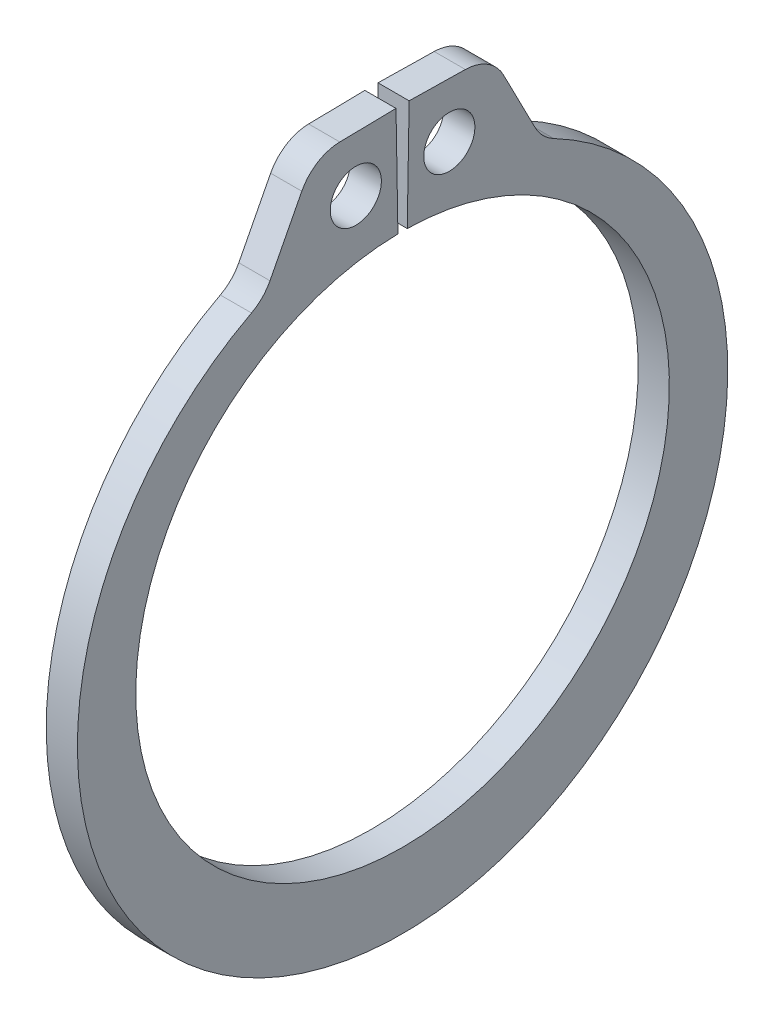
ISO-10303-21;
HEADER;
FILE_DESCRIPTION(('STEP AP214'),'2;1');
FILE_NAME('part.step','',(''),(''),'','','');
FILE_SCHEMA(('AUTOMOTIVE_DESIGN { 1 0 10303 214 1 1 1 1 }'));
ENDSEC;
DATA;
#1=APPLICATION_CONTEXT('core data for automotive mechanical design processes');
#2=APPLICATION_PROTOCOL_DEFINITION('international standard','automotive_design',2000,#1);
#3=PRODUCT_CONTEXT('',#1,'mechanical');
#4=PRODUCT('Part','Part','',(#3));
#5=PRODUCT_RELATED_PRODUCT_CATEGORY('part','',(#4));
#6=PRODUCT_DEFINITION_FORMATION('','',#4);
#7=PRODUCT_DEFINITION_CONTEXT('part definition',#1,'design');
#8=PRODUCT_DEFINITION('design','',#6,#7);
#9=PRODUCT_DEFINITION_SHAPE('','',#8);
#10=(LENGTH_UNIT() NAMED_UNIT(*) SI_UNIT(.MILLI.,.METRE.));
#11=(NAMED_UNIT(*) PLANE_ANGLE_UNIT() SI_UNIT($,.RADIAN.));
#12=(NAMED_UNIT(*) SI_UNIT($,.STERADIAN.) SOLID_ANGLE_UNIT());
#13=UNCERTAINTY_MEASURE_WITH_UNIT(LENGTH_MEASURE(1.E-05),#10,'distance_accuracy_value','');
#14=(GEOMETRIC_REPRESENTATION_CONTEXT(3) GLOBAL_UNCERTAINTY_ASSIGNED_CONTEXT((#13)) GLOBAL_UNIT_ASSIGNED_CONTEXT((#10,
#11,#12)) REPRESENTATION_CONTEXT('',''));
#15=CARTESIAN_POINT('',(0.,0.,0.));
#16=DIRECTION('',(0.,0.,1.));
#17=DIRECTION('',(1.,0.,0.));
#18=AXIS2_PLACEMENT_3D('',#15,#16,#17);
#19=CARTESIAN_POINT('',(0.3175,0.,0.));
#20=DIRECTION('',(1.,0.,0.));
#21=DIRECTION('',(0.,0.,-1.));
#22=AXIS2_PLACEMENT_3D('',#19,#20,#21);
#23=PLANE('',#22);
#24=CARTESIAN_POINT('',(0.3175,6.53757330882311,0.952441447944874));
#25=DIRECTION('',(1.,0.,0.));
#26=DIRECTION('',(0.,0.,-1.));
#27=AXIS2_PLACEMENT_3D('',#24,#25,#26);
#28=CIRCLE('',#27,0.5207);
#29=CARTESIAN_POINT('',(0.3175,6.53757330882311,0.431741447944874));
#30=VERTEX_POINT('',#29);
#31=EDGE_CURVE('E229',#30,#30,#28,.T.);
#32=ORIENTED_EDGE('',*,*,#31,.F.);
#33=EDGE_LOOP('',(#32));
#34=FACE_BOUND('',#33,.T.);
#35=DIRECTION('',(0.,-0.0174524064372771,0.999847695156391));
#36=VECTOR('',#35,1.);
#37=CARTESIAN_POINT('',(0.3175,7.66963170000565,0.133873919299115));
#38=LINE('',#37,#36);
#39=CARTESIAN_POINT('',(0.3175,7.66963170000565,0.133873919299115));
#40=VERTEX_POINT('',#39);
#41=CARTESIAN_POINT('',(0.3175,7.64964498771418,1.27891189960262));
#42=VERTEX_POINT('',#41);
#43=EDGE_CURVE('E141',#40,#42,#38,.T.);
#44=ORIENTED_EDGE('',*,*,#43,.T.);
#45=CARTESIAN_POINT('',(0.3175,6.76078038672015,1.26339671027988));
#46=DIRECTION('',(1.,0.,0.));
#47=DIRECTION('',(0.,0.,-1.));
#48=AXIS2_PLACEMENT_3D('',#45,#46,#47);
#49=CIRCLE('',#48,0.889);
#50=CARTESIAN_POINT('',(0.3175,7.16827724391612,2.05350259645933));
#51=VERTEX_POINT('',#50);
#52=EDGE_CURVE('E182',#42,#51,#49,.T.);
#53=ORIENTED_EDGE('',*,*,#52,.T.);
#54=DIRECTION('',(0.,-0.888758027198479,0.458376667262055));
#55=VECTOR('',#54,1.);
#56=CARTESIAN_POINT('',(0.3175,7.6403744858542,1.81001859545929));
#57=LINE('',#56,#55);
#58=CARTESIAN_POINT('',(0.3175,5.91184475207108,2.70150725085));
#59=VERTEX_POINT('',#58);
#60=EDGE_CURVE('E221',#51,#59,#57,.T.);
#61=ORIENTED_EDGE('',*,*,#60,.T.);
#62=CARTESIAN_POINT('',(0.3175,6.31934160926705,3.49161313702945));
#63=DIRECTION('',(1.,0.,0.));
#64=DIRECTION('',(0.,0.,-1.));
#65=AXIS2_PLACEMENT_3D('',#62,#63,#64);
#66=CIRCLE('',#65,0.889);
#67=CARTESIAN_POINT('',(0.3175,5.5321453172725,3.07852356094451));
#68=VERTEX_POINT('',#67);
#69=EDGE_CURVE('E189',#59,#68,#66,.F.);
#70=ORIENTED_EDGE('',*,*,#69,.T.);
#71=CARTESIAN_POINT('',(0.3175,-0.334384540394782,0.));
#72=DIRECTION('',(1.,0.,0.));
#73=DIRECTION('',(0.,0.,-1.));
#74=AXIS2_PLACEMENT_3D('',#71,#72,#73);
#75=CIRCLE('',#74,6.62521545960523);
#76=CARTESIAN_POINT('',(0.3175,5.5321453172725,-3.07852356094451));
#77=VERTEX_POINT('',#76);
#78=EDGE_CURVE('E214',#68,#77,#75,.T.);
#79=ORIENTED_EDGE('',*,*,#78,.T.);
#80=CARTESIAN_POINT('',(0.3175,6.31934160926705,-3.49161313702945));
#81=DIRECTION('',(1.,0.,0.));
#82=DIRECTION('',(0.,0.,-1.));
#83=AXIS2_PLACEMENT_3D('',#80,#81,#82);
#84=CIRCLE('',#83,0.889);
#85=CARTESIAN_POINT('',(0.3175,5.91184475207108,-2.70150725085));
#86=VERTEX_POINT('',#85);
#87=EDGE_CURVE('E13',#77,#86,#84,.F.);
#88=ORIENTED_EDGE('',*,*,#87,.T.);
#89=DIRECTION('',(0.,0.888758027198479,0.458376667262055));
#90=VECTOR('',#89,1.);
#91=CARTESIAN_POINT('',(0.3175,7.6403744858542,-1.81001859545929));
#92=LINE('',#91,#90);
#93=CARTESIAN_POINT('',(0.3175,7.16827724391612,-2.05350259645933));
#94=VERTEX_POINT('',#93);
#95=EDGE_CURVE('E213',#86,#94,#92,.T.);
#96=ORIENTED_EDGE('',*,*,#95,.T.);
#97=CARTESIAN_POINT('',(0.3175,6.76078038672015,-1.26339671027988));
#98=DIRECTION('',(1.,0.,0.));
#99=DIRECTION('',(0.,0.,-1.));
#100=AXIS2_PLACEMENT_3D('',#97,#98,#99);
#101=CIRCLE('',#100,0.889);
#102=CARTESIAN_POINT('',(0.3175,7.64964498771418,-1.27891189960262));
#103=VERTEX_POINT('',#102);
#104=EDGE_CURVE('E57',#94,#103,#101,.T.);
#105=ORIENTED_EDGE('',*,*,#104,.T.);
#106=DIRECTION('',(0.,0.0174524064372771,0.999847695156391));
#107=VECTOR('',#106,1.);
#108=CARTESIAN_POINT('',(0.3175,7.66963170000565,-0.133873919299115));
#109=LINE('',#108,#107);
#110=CARTESIAN_POINT('',(0.3175,7.66963170000565,-0.133873919299115));
#111=VERTEX_POINT('',#110);
#112=EDGE_CURVE('E218',#103,#111,#109,.T.);
#113=ORIENTED_EDGE('',*,*,#112,.T.);
#114=DIRECTION('',(0.,-0.999847695156391,0.0174524064372833));
#115=VECTOR('',#114,1.);
#116=CARTESIAN_POINT('',(0.3175,5.43477213179208,-0.0948643004304991));
#117=LINE('',#116,#115);
#118=CARTESIAN_POINT('',(0.3175,5.43477213179208,-0.0948643004304991));
#119=VERTEX_POINT('',#118);
#120=EDGE_CURVE('E147',#111,#119,#117,.T.);
#121=ORIENTED_EDGE('',*,*,#120,.T.);
#122=CARTESIAN_POINT('',(0.3175,0.,0.));
#123=DIRECTION('',(-1.,0.,0.));
#124=DIRECTION('',(0.,0.,-1.));
#125=AXIS2_PLACEMENT_3D('',#122,#123,#124);
#126=CIRCLE('',#125,5.4356);
#127=CARTESIAN_POINT('',(0.3175,5.43477213179208,0.0948643004304991));
#128=VERTEX_POINT('',#127);
#129=EDGE_CURVE('E142',#119,#128,#126,.T.);
#130=ORIENTED_EDGE('',*,*,#129,.T.);
#131=DIRECTION('',(0.,0.999847695156391,0.0174524064372833));
#132=VECTOR('',#131,1.);
#133=CARTESIAN_POINT('',(0.3175,5.43477213179208,0.0948643004304991));
#134=LINE('',#133,#132);
#135=EDGE_CURVE('E133',#128,#40,#134,.T.);
#136=ORIENTED_EDGE('',*,*,#135,.T.);
#137=EDGE_LOOP('',(#44,#53,#61,#70,#79,#88,#96,#105,#113,#121,#130,#136));
#138=FACE_BOUND('',#137,.T.);
#139=CARTESIAN_POINT('',(0.3175,6.53757330882311,-0.952441447944874));
#140=DIRECTION('',(1.,0.,0.));
#141=DIRECTION('',(0.,0.,-1.));
#142=AXIS2_PLACEMENT_3D('',#139,#140,#141);
#143=CIRCLE('',#142,0.5207);
#144=CARTESIAN_POINT('',(0.3175,6.53757330882311,-1.47314144794487));
#145=VERTEX_POINT('',#144);
#146=EDGE_CURVE('E255',#145,#145,#143,.T.);
#147=ORIENTED_EDGE('',*,*,#146,.F.);
#148=EDGE_LOOP('',(#147));
#149=FACE_BOUND('',#148,.T.);
#150=ADVANCED_FACE('F42',(#34,#138,#149),#23,.T.);
#151=CARTESIAN_POINT('',(-0.3175,0.,0.));
#152=DIRECTION('',(1.,0.,0.));
#153=DIRECTION('',(0.,0.,-1.));
#154=AXIS2_PLACEMENT_3D('',#151,#152,#153);
#155=PLANE('',#154);
#156=CARTESIAN_POINT('',(-0.3175,6.53757330882311,0.952441447944874));
#157=DIRECTION('',(1.,0.,0.));
#158=DIRECTION('',(0.,0.,-1.));
#159=AXIS2_PLACEMENT_3D('',#156,#157,#158);
#160=CIRCLE('',#159,0.5207);
#161=CARTESIAN_POINT('',(-0.3175,6.53757330882311,0.431741447944874));
#162=VERTEX_POINT('',#161);
#163=EDGE_CURVE('E252',#162,#162,#160,.T.);
#164=ORIENTED_EDGE('',*,*,#163,.T.);
#165=EDGE_LOOP('',(#164));
#166=FACE_BOUND('',#165,.T.);
#167=DIRECTION('',(0.,-0.888758027198479,0.458376667262055));
#168=VECTOR('',#167,1.);
#169=CARTESIAN_POINT('',(-0.3175,7.6403744858542,1.81001859545929));
#170=LINE('',#169,#168);
#171=CARTESIAN_POINT('',(-0.3175,7.16827724391612,2.05350259645933));
#172=VERTEX_POINT('',#171);
#173=CARTESIAN_POINT('',(-0.3175,5.91184475207108,2.70150725085));
#174=VERTEX_POINT('',#173);
#175=EDGE_CURVE('E208',#172,#174,#170,.T.);
#176=ORIENTED_EDGE('',*,*,#175,.F.);
#177=CARTESIAN_POINT('',(-0.3175,6.76078038672015,1.26339671027988));
#178=DIRECTION('',(1.,0.,0.));
#179=DIRECTION('',(0.,0.,-1.));
#180=AXIS2_PLACEMENT_3D('',#177,#178,#179);
#181=CIRCLE('',#180,0.889);
#182=CARTESIAN_POINT('',(-0.3175,7.64964498771418,1.27891189960262));
#183=VERTEX_POINT('',#182);
#184=EDGE_CURVE('E178',#172,#183,#181,.F.);
#185=ORIENTED_EDGE('',*,*,#184,.T.);
#186=DIRECTION('',(0.,-0.0174524064372771,0.999847695156391));
#187=VECTOR('',#186,1.);
#188=CARTESIAN_POINT('',(-0.3175,7.66963170000565,0.133873919299115));
#189=LINE('',#188,#187);
#190=CARTESIAN_POINT('',(-0.3175,7.66963170000565,0.133873919299115));
#191=VERTEX_POINT('',#190);
#192=EDGE_CURVE('E231',#191,#183,#189,.T.);
#193=ORIENTED_EDGE('',*,*,#192,.F.);
#194=DIRECTION('',(0.,0.999847695156391,0.0174524064372833));
#195=VECTOR('',#194,1.);
#196=CARTESIAN_POINT('',(-0.3175,5.43477213179208,0.0948643004304991));
#197=LINE('',#196,#195);
#198=CARTESIAN_POINT('',(-0.3175,5.43477213179208,0.0948643004304991));
#199=VERTEX_POINT('',#198);
#200=EDGE_CURVE('E228',#199,#191,#197,.T.);
#201=ORIENTED_EDGE('',*,*,#200,.F.);
#202=CARTESIAN_POINT('',(-0.3175,0.,0.));
#203=DIRECTION('',(-1.,0.,0.));
#204=DIRECTION('',(0.,0.,-1.));
#205=AXIS2_PLACEMENT_3D('',#202,#203,#204);
#206=CIRCLE('',#205,5.4356);
#207=CARTESIAN_POINT('',(-0.3175,5.43477213179208,-0.0948643004304991));
#208=VERTEX_POINT('',#207);
#209=EDGE_CURVE('E155',#208,#199,#206,.T.);
#210=ORIENTED_EDGE('',*,*,#209,.F.);
#211=DIRECTION('',(0.,-0.999847695156391,0.0174524064372833));
#212=VECTOR('',#211,1.);
#213=CARTESIAN_POINT('',(-0.3175,5.43477213179208,-0.0948643004304991));
#214=LINE('',#213,#212);
#215=CARTESIAN_POINT('',(-0.3175,7.66963170000565,-0.133873919299115));
#216=VERTEX_POINT('',#215);
#217=EDGE_CURVE('E151',#216,#208,#214,.T.);
#218=ORIENTED_EDGE('',*,*,#217,.F.);
#219=DIRECTION('',(0.,0.0174524064372771,0.999847695156391));
#220=VECTOR('',#219,1.);
#221=CARTESIAN_POINT('',(-0.3175,7.66963170000565,-0.133873919299115));
#222=LINE('',#221,#220);
#223=CARTESIAN_POINT('',(-0.3175,7.64964498771418,-1.27891189960262));
#224=VERTEX_POINT('',#223);
#225=EDGE_CURVE('E236',#224,#216,#222,.T.);
#226=ORIENTED_EDGE('',*,*,#225,.F.);
#227=CARTESIAN_POINT('',(-0.3175,6.76078038672015,-1.26339671027988));
#228=DIRECTION('',(1.,0.,0.));
#229=DIRECTION('',(0.,0.,-1.));
#230=AXIS2_PLACEMENT_3D('',#227,#228,#229);
#231=CIRCLE('',#230,0.889);
#232=CARTESIAN_POINT('',(-0.3175,7.16827724391612,-2.05350259645933));
#233=VERTEX_POINT('',#232);
#234=EDGE_CURVE('E176',#224,#233,#231,.F.);
#235=ORIENTED_EDGE('',*,*,#234,.T.);
#236=DIRECTION('',(0.,0.888758027198479,0.458376667262055));
#237=VECTOR('',#236,1.);
#238=CARTESIAN_POINT('',(-0.3175,7.6403744858542,-1.81001859545929));
#239=LINE('',#238,#237);
#240=CARTESIAN_POINT('',(-0.3175,5.91184475207108,-2.70150725085));
#241=VERTEX_POINT('',#240);
#242=EDGE_CURVE('E199',#241,#233,#239,.T.);
#243=ORIENTED_EDGE('',*,*,#242,.F.);
#244=CARTESIAN_POINT('',(-0.3175,6.31934160926705,-3.49161313702945));
#245=DIRECTION('',(1.,0.,0.));
#246=DIRECTION('',(0.,0.,-1.));
#247=AXIS2_PLACEMENT_3D('',#244,#245,#246);
#248=CIRCLE('',#247,0.889);
#249=CARTESIAN_POINT('',(-0.3175,5.5321453172725,-3.07852356094451));
#250=VERTEX_POINT('',#249);
#251=EDGE_CURVE('E50',#241,#250,#248,.T.);
#252=ORIENTED_EDGE('',*,*,#251,.T.);
#253=CARTESIAN_POINT('',(-0.3175,-0.334384540394782,0.));
#254=DIRECTION('',(1.,0.,0.));
#255=DIRECTION('',(0.,0.,-1.));
#256=AXIS2_PLACEMENT_3D('',#253,#254,#255);
#257=CIRCLE('',#256,6.62521545960523);
#258=CARTESIAN_POINT('',(-0.3175,5.5321453172725,3.07852356094451));
#259=VERTEX_POINT('',#258);
#260=EDGE_CURVE('E197',#259,#250,#257,.T.);
#261=ORIENTED_EDGE('',*,*,#260,.F.);
#262=CARTESIAN_POINT('',(-0.3175,6.31934160926705,3.49161313702945));
#263=DIRECTION('',(1.,0.,0.));
#264=DIRECTION('',(0.,0.,-1.));
#265=AXIS2_PLACEMENT_3D('',#262,#263,#264);
#266=CIRCLE('',#265,0.889);
#267=EDGE_CURVE('E187',#259,#174,#266,.T.);
#268=ORIENTED_EDGE('',*,*,#267,.T.);
#269=EDGE_LOOP('',(#176,#185,#193,#201,#210,#218,#226,#235,#243,#252,#261,#268));
#270=FACE_BOUND('',#269,.T.);
#271=CARTESIAN_POINT('',(-0.3175,6.53757330882311,-0.952441447944874));
#272=DIRECTION('',(1.,0.,0.));
#273=DIRECTION('',(0.,0.,-1.));
#274=AXIS2_PLACEMENT_3D('',#271,#272,#273);
#275=CIRCLE('',#274,0.5207);
#276=CARTESIAN_POINT('',(-0.3175,6.53757330882311,-1.47314144794487));
#277=VERTEX_POINT('',#276);
#278=EDGE_CURVE('E258',#277,#277,#275,.T.);
#279=ORIENTED_EDGE('',*,*,#278,.T.);
#280=EDGE_LOOP('',(#279));
#281=FACE_BOUND('',#280,.T.);
#282=ADVANCED_FACE('F195',(#166,#270,#281),#155,.F.);
#283=CARTESIAN_POINT('',(0.3175,0.,0.));
#284=DIRECTION('',(-1.,0.,0.));
#285=DIRECTION('',(0.,0.,1.));
#286=AXIS2_PLACEMENT_3D('',#283,#284,#285);
#287=CYLINDRICAL_SURFACE('',#286,5.4356);
#288=ORIENTED_EDGE('',*,*,#209,.T.);
#289=DIRECTION('',(-1.,0.,0.));
#290=VECTOR('',#289,1.);
#291=CARTESIAN_POINT('',(0.3175,5.43477213179208,0.0948643004304991));
#292=LINE('',#291,#290);
#293=EDGE_CURVE('E137',#128,#199,#292,.T.);
#294=ORIENTED_EDGE('',*,*,#293,.F.);
#295=ORIENTED_EDGE('',*,*,#129,.F.);
#296=DIRECTION('',(-1.,0.,0.));
#297=VECTOR('',#296,1.);
#298=CARTESIAN_POINT('',(0.3175,5.43477213179208,-0.0948643004304991));
#299=LINE('',#298,#297);
#300=EDGE_CURVE('E226',#119,#208,#299,.T.);
#301=ORIENTED_EDGE('',*,*,#300,.T.);
#302=EDGE_LOOP('',(#288,#294,#295,#301));
#303=FACE_BOUND('',#302,.T.);
#304=ADVANCED_FACE('F153',(#303),#287,.F.);
#305=CARTESIAN_POINT('',(0.3175,5.43477213179208,0.0948643004304991));
#306=DIRECTION('',(0.,-0.0174524064372833,0.999847695156391));
#307=DIRECTION('',(0.,-0.999847695156391,-0.0174524064372833));
#308=AXIS2_PLACEMENT_3D('',#305,#306,#307);
#309=PLANE('',#308);
#310=ORIENTED_EDGE('',*,*,#200,.T.);
#311=DIRECTION('',(-1.,0.,0.));
#312=VECTOR('',#311,1.);
#313=CARTESIAN_POINT('',(0.3175,7.66963170000565,0.133873919299115));
#314=LINE('',#313,#312);
#315=EDGE_CURVE('E140',#40,#191,#314,.T.);
#316=ORIENTED_EDGE('',*,*,#315,.F.);
#317=ORIENTED_EDGE('',*,*,#135,.F.);
#318=ORIENTED_EDGE('',*,*,#293,.T.);
#319=EDGE_LOOP('',(#310,#316,#317,#318));
#320=FACE_BOUND('',#319,.T.);
#321=ADVANCED_FACE('F135',(#320),#309,.F.);
#322=CARTESIAN_POINT('',(0.3175,7.66963170000565,0.133873919299115));
#323=DIRECTION('',(0.,-0.999847695156391,-0.0174524064372771));
#324=DIRECTION('',(0.,0.0174524064372771,-0.999847695156391));
#325=AXIS2_PLACEMENT_3D('',#322,#323,#324);
#326=PLANE('',#325);
#327=ORIENTED_EDGE('',*,*,#192,.T.);
#328=DIRECTION('',(-1.,0.,0.));
#329=VECTOR('',#328,1.);
#330=CARTESIAN_POINT('',(0.3175,7.64964498771418,1.27891189960262));
#331=LINE('',#330,#329);
#332=EDGE_CURVE('E65',#183,#42,#331,.F.);
#333=ORIENTED_EDGE('',*,*,#332,.T.);
#334=ORIENTED_EDGE('',*,*,#43,.F.);
#335=ORIENTED_EDGE('',*,*,#315,.T.);
#336=EDGE_LOOP('',(#327,#333,#334,#335));
#337=FACE_BOUND('',#336,.T.);
#338=ADVANCED_FACE('F247',(#337),#326,.F.);
#339=CARTESIAN_POINT('',(0.3175,7.6403744858542,1.81001859545929));
#340=DIRECTION('',(0.,-0.458376667262055,-0.888758027198479));
#341=DIRECTION('',(0.,0.888758027198479,-0.458376667262055));
#342=AXIS2_PLACEMENT_3D('',#339,#340,#341);
#343=PLANE('',#342);
#344=ORIENTED_EDGE('',*,*,#175,.T.);
#345=DIRECTION('',(1.,0.,0.));
#346=VECTOR('',#345,1.);
#347=CARTESIAN_POINT('',(0.3175,5.91184475207108,2.70150725085));
#348=LINE('',#347,#346);
#349=EDGE_CURVE('E169',#174,#59,#348,.T.);
#350=ORIENTED_EDGE('',*,*,#349,.T.);
#351=ORIENTED_EDGE('',*,*,#60,.F.);
#352=DIRECTION('',(-1.,0.,0.));
#353=VECTOR('',#352,1.);
#354=CARTESIAN_POINT('',(0.3175,7.16827724391612,2.05350259645933));
#355=LINE('',#354,#353);
#356=EDGE_CURVE('E166',#51,#172,#355,.T.);
#357=ORIENTED_EDGE('',*,*,#356,.T.);
#358=EDGE_LOOP('',(#344,#350,#351,#357));
#359=FACE_BOUND('',#358,.T.);
#360=ADVANCED_FACE('F288',(#359),#343,.F.);
#361=CARTESIAN_POINT('',(0.3175,-0.334384540394782,0.));
#362=DIRECTION('',(-1.,0.,0.));
#363=DIRECTION('',(0.,0.,1.));
#364=AXIS2_PLACEMENT_3D('',#361,#362,#363);
#365=CYLINDRICAL_SURFACE('',#364,6.62521545960523);
#366=ORIENTED_EDGE('',*,*,#78,.F.);
#367=DIRECTION('',(-1.,0.,0.));
#368=VECTOR('',#367,1.);
#369=CARTESIAN_POINT('',(0.3175,5.53214531727249,3.07852356094451));
#370=LINE('',#369,#368);
#371=EDGE_CURVE('E158',#68,#259,#370,.T.);
#372=ORIENTED_EDGE('',*,*,#371,.T.);
#373=ORIENTED_EDGE('',*,*,#260,.T.);
#374=DIRECTION('',(-1.,0.,0.));
#375=VECTOR('',#374,1.);
#376=CARTESIAN_POINT('',(0.3175,5.53214531727249,-3.07852356094451));
#377=LINE('',#376,#375);
#378=EDGE_CURVE('E156',#250,#77,#377,.F.);
#379=ORIENTED_EDGE('',*,*,#378,.T.);
#380=EDGE_LOOP('',(#366,#372,#373,#379));
#381=FACE_BOUND('',#380,.T.);
#382=ADVANCED_FACE('F205',(#381),#365,.T.);
#383=CARTESIAN_POINT('',(0.3175,7.6403744858542,-1.81001859545929));
#384=DIRECTION('',(0.,-0.458376667262055,0.888758027198479));
#385=DIRECTION('',(0.,-0.888758027198479,-0.458376667262055));
#386=AXIS2_PLACEMENT_3D('',#383,#384,#385);
#387=PLANE('',#386);
#388=ORIENTED_EDGE('',*,*,#95,.F.);
#389=DIRECTION('',(1.,0.,0.));
#390=VECTOR('',#389,1.);
#391=CARTESIAN_POINT('',(-0.3175,5.91184475207108,-2.70150725085));
#392=LINE('',#391,#390);
#393=EDGE_CURVE('E173',#86,#241,#392,.F.);
#394=ORIENTED_EDGE('',*,*,#393,.T.);
#395=ORIENTED_EDGE('',*,*,#242,.T.);
#396=DIRECTION('',(-1.,0.,0.));
#397=VECTOR('',#396,1.);
#398=CARTESIAN_POINT('',(0.3175,7.16827724391612,-2.05350259645933));
#399=LINE('',#398,#397);
#400=EDGE_CURVE('E171',#233,#94,#399,.F.);
#401=ORIENTED_EDGE('',*,*,#400,.T.);
#402=EDGE_LOOP('',(#388,#394,#395,#401));
#403=FACE_BOUND('',#402,.T.);
#404=ADVANCED_FACE('F216',(#403),#387,.F.);
#405=CARTESIAN_POINT('',(0.3175,7.66963170000565,-0.133873919299115));
#406=DIRECTION('',(0.,-0.999847695156391,0.0174524064372771));
#407=DIRECTION('',(0.,-0.0174524064372771,-0.999847695156391));
#408=AXIS2_PLACEMENT_3D('',#405,#406,#407);
#409=PLANE('',#408);
#410=ORIENTED_EDGE('',*,*,#112,.F.);
#411=DIRECTION('',(-1.,0.,0.));
#412=VECTOR('',#411,1.);
#413=CARTESIAN_POINT('',(0.3175,7.64964498771418,-1.27891189960262));
#414=LINE('',#413,#412);
#415=EDGE_CURVE('E184',#103,#224,#414,.T.);
#416=ORIENTED_EDGE('',*,*,#415,.T.);
#417=ORIENTED_EDGE('',*,*,#225,.T.);
#418=DIRECTION('',(-1.,0.,0.));
#419=VECTOR('',#418,1.);
#420=CARTESIAN_POINT('',(0.3175,7.66963170000565,-0.133873919299115));
#421=LINE('',#420,#419);
#422=EDGE_CURVE('E160',#111,#216,#421,.T.);
#423=ORIENTED_EDGE('',*,*,#422,.F.);
#424=EDGE_LOOP('',(#410,#416,#417,#423));
#425=FACE_BOUND('',#424,.T.);
#426=ADVANCED_FACE('F281',(#425),#409,.F.);
#427=CARTESIAN_POINT('',(0.3175,5.43477213179208,-0.0948643004304991));
#428=DIRECTION('',(0.,-0.0174524064372833,-0.999847695156391));
#429=DIRECTION('',(0.,0.999847695156391,-0.0174524064372833));
#430=AXIS2_PLACEMENT_3D('',#427,#428,#429);
#431=PLANE('',#430);
#432=ORIENTED_EDGE('',*,*,#217,.T.);
#433=ORIENTED_EDGE('',*,*,#300,.F.);
#434=ORIENTED_EDGE('',*,*,#120,.F.);
#435=ORIENTED_EDGE('',*,*,#422,.T.);
#436=EDGE_LOOP('',(#432,#433,#434,#435));
#437=FACE_BOUND('',#436,.T.);
#438=ADVANCED_FACE('F243',(#437),#431,.F.);
#439=CARTESIAN_POINT('',(0.3175,6.53757330882311,0.952441447944874));
#440=DIRECTION('',(-1.,0.,0.));
#441=DIRECTION('',(0.,0.,1.));
#442=AXIS2_PLACEMENT_3D('',#439,#440,#441);
#443=CYLINDRICAL_SURFACE('',#442,0.5207);
#444=ORIENTED_EDGE('',*,*,#31,.T.);
#445=EDGE_LOOP('',(#444));
#446=FACE_BOUND('',#445,.T.);
#447=ORIENTED_EDGE('',*,*,#163,.F.);
#448=EDGE_LOOP('',(#447));
#449=FACE_BOUND('',#448,.T.);
#450=ADVANCED_FACE('F276',(#446,#449),#443,.F.);
#451=CARTESIAN_POINT('',(0.3175,6.53757330882311,-0.952441447944874));
#452=DIRECTION('',(-1.,0.,0.));
#453=DIRECTION('',(0.,0.,1.));
#454=AXIS2_PLACEMENT_3D('',#451,#452,#453);
#455=CYLINDRICAL_SURFACE('',#454,0.5207);
#456=ORIENTED_EDGE('',*,*,#146,.T.);
#457=EDGE_LOOP('',(#456));
#458=FACE_BOUND('',#457,.T.);
#459=ORIENTED_EDGE('',*,*,#278,.F.);
#460=EDGE_LOOP('',(#459));
#461=FACE_BOUND('',#460,.T.);
#462=ADVANCED_FACE('F264',(#458,#461),#455,.F.);
#463=CARTESIAN_POINT('',(0.3175,6.31934160926705,3.49161313702945));
#464=DIRECTION('',(-1.,0.,0.));
#465=DIRECTION('',(0.,0.,1.));
#466=AXIS2_PLACEMENT_3D('',#463,#464,#465);
#467=CYLINDRICAL_SURFACE('',#466,0.889);
#468=ORIENTED_EDGE('',*,*,#69,.F.);
#469=ORIENTED_EDGE('',*,*,#349,.F.);
#470=ORIENTED_EDGE('',*,*,#267,.F.);
#471=ORIENTED_EDGE('',*,*,#371,.F.);
#472=EDGE_LOOP('',(#468,#469,#470,#471));
#473=FACE_BOUND('',#472,.T.);
#474=ADVANCED_FACE('F298',(#473),#467,.F.);
#475=CARTESIAN_POINT('',(0.3175,6.31934160926705,-3.49161313702945));
#476=DIRECTION('',(-1.,0.,0.));
#477=DIRECTION('',(0.,0.,1.));
#478=AXIS2_PLACEMENT_3D('',#475,#476,#477);
#479=CYLINDRICAL_SURFACE('',#478,0.889);
#480=ORIENTED_EDGE('',*,*,#87,.F.);
#481=ORIENTED_EDGE('',*,*,#378,.F.);
#482=ORIENTED_EDGE('',*,*,#251,.F.);
#483=ORIENTED_EDGE('',*,*,#393,.F.);
#484=EDGE_LOOP('',(#480,#481,#482,#483));
#485=FACE_BOUND('',#484,.T.);
#486=ADVANCED_FACE('F211',(#485),#479,.F.);
#487=CARTESIAN_POINT('',(0.3175,6.76078038672015,1.26339671027988));
#488=DIRECTION('',(-1.,0.,0.));
#489=DIRECTION('',(0.,0.,1.));
#490=AXIS2_PLACEMENT_3D('',#487,#488,#489);
#491=CYLINDRICAL_SURFACE('',#490,0.889);
#492=ORIENTED_EDGE('',*,*,#52,.F.);
#493=ORIENTED_EDGE('',*,*,#332,.F.);
#494=ORIENTED_EDGE('',*,*,#184,.F.);
#495=ORIENTED_EDGE('',*,*,#356,.F.);
#496=EDGE_LOOP('',(#492,#493,#494,#495));
#497=FACE_BOUND('',#496,.T.);
#498=ADVANCED_FACE('F303',(#497),#491,.T.);
#499=CARTESIAN_POINT('',(0.3175,6.76078038672015,-1.26339671027988));
#500=DIRECTION('',(-1.,0.,0.));
#501=DIRECTION('',(0.,0.,1.));
#502=AXIS2_PLACEMENT_3D('',#499,#500,#501);
#503=CYLINDRICAL_SURFACE('',#502,0.889);
#504=ORIENTED_EDGE('',*,*,#104,.F.);
#505=ORIENTED_EDGE('',*,*,#400,.F.);
#506=ORIENTED_EDGE('',*,*,#234,.F.);
#507=ORIENTED_EDGE('',*,*,#415,.F.);
#508=EDGE_LOOP('',(#504,#505,#506,#507));
#509=FACE_BOUND('',#508,.T.);
#510=ADVANCED_FACE('F44',(#509),#503,.T.);
#511=CLOSED_SHELL('',(#150,#282,#304,#321,#338,#360,#382,#404,#426,#438,#450,#462,#474,#486,
#498,#510));
#512=MANIFOLD_SOLID_BREP('B2',#511);
#513=ADVANCED_BREP_SHAPE_REPRESENTATION('',(#18,#512),#14);
#514=SHAPE_DEFINITION_REPRESENTATION(#9,#513);
ENDSEC;
END-ISO-10303-21;
